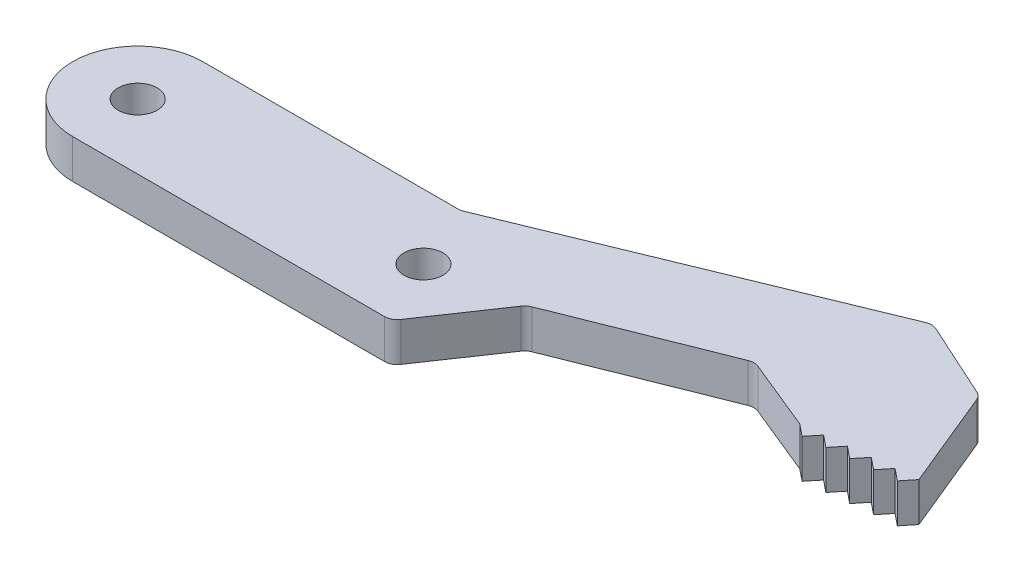
ISO-10303-21;
HEADER;
FILE_DESCRIPTION(('STEP AP214'),'2;1');
FILE_NAME('part.step','',(''),(''),'','','');
FILE_SCHEMA(('AUTOMOTIVE_DESIGN { 1 0 10303 214 1 1 1 1 }'));
ENDSEC;
DATA;
#1=APPLICATION_CONTEXT('core data for automotive mechanical design processes');
#2=APPLICATION_PROTOCOL_DEFINITION('international standard','automotive_design',2000,#1);
#3=PRODUCT_CONTEXT('',#1,'mechanical');
#4=PRODUCT('Part','Part','',(#3));
#5=PRODUCT_RELATED_PRODUCT_CATEGORY('part','',(#4));
#6=PRODUCT_DEFINITION_FORMATION('','',#4);
#7=PRODUCT_DEFINITION_CONTEXT('part definition',#1,'design');
#8=PRODUCT_DEFINITION('design','',#6,#7);
#9=PRODUCT_DEFINITION_SHAPE('','',#8);
#10=(LENGTH_UNIT() NAMED_UNIT(*) SI_UNIT(.MILLI.,.METRE.));
#11=(NAMED_UNIT(*) PLANE_ANGLE_UNIT() SI_UNIT($,.RADIAN.));
#12=(NAMED_UNIT(*) SI_UNIT($,.STERADIAN.) SOLID_ANGLE_UNIT());
#13=UNCERTAINTY_MEASURE_WITH_UNIT(LENGTH_MEASURE(1.E-05),#10,'distance_accuracy_value','');
#14=(GEOMETRIC_REPRESENTATION_CONTEXT(3) GLOBAL_UNCERTAINTY_ASSIGNED_CONTEXT((#13)) GLOBAL_UNIT_ASSIGNED_CONTEXT((#10,
#11,#12)) REPRESENTATION_CONTEXT('',''));
#15=CARTESIAN_POINT('',(0.,0.,0.));
#16=DIRECTION('',(0.,0.,1.));
#17=DIRECTION('',(1.,0.,0.));
#18=AXIS2_PLACEMENT_3D('',#15,#16,#17);
#19=CARTESIAN_POINT('',(29.3927079970185,3.,-0.393076672311641));
#20=DIRECTION('',(0.,-1.,0.));
#21=DIRECTION('',(0.,0.,-1.));
#22=AXIS2_PLACEMENT_3D('',#19,#20,#21);
#23=PLANE('',#22);
#24=CARTESIAN_POINT('',(29.3927079970185,3.,-0.393076672311641));
#25=DIRECTION('',(0.,-1.,0.));
#26=DIRECTION('',(0.,0.,-1.));
#27=AXIS2_PLACEMENT_3D('',#24,#25,#26);
#28=CIRCLE('',#27,1.);
#29=CARTESIAN_POINT('',(28.5649413257824,3.,-0.954149161381216));
#30=VERTEX_POINT('',#29);
#31=CARTESIAN_POINT('',(29.022312673,3.,-1.32195088551018));
#32=VERTEX_POINT('',#31);
#33=EDGE_CURVE('E282',#30,#32,#28,.T.);
#34=ORIENTED_EDGE('',*,*,#33,.T.);
#35=DIRECTION('',(0.92887421319854,0.,-0.370395324018532));
#36=VECTOR('',#35,1.);
#37=CARTESIAN_POINT('',(29.022312673,3.,-1.32195088551018));
#38=LINE('',#37,#36);
#39=CARTESIAN_POINT('',(40.9295532164884,3.,-6.07004934341117));
#40=VERTEX_POINT('',#39);
#41=EDGE_CURVE('E145',#32,#40,#38,.T.);
#42=ORIENTED_EDGE('',*,*,#41,.T.);
#43=CARTESIAN_POINT('',(41.2999485405069,3.,-5.14117513021263));
#44=DIRECTION('',(0.,-1.,0.));
#45=DIRECTION('',(0.,0.,-1.));
#46=AXIS2_PLACEMENT_3D('',#43,#44,#45);
#47=CIRCLE('',#46,1.);
#48=CARTESIAN_POINT('',(41.6787586893829,3.,-6.06664953348294));
#49=VERTEX_POINT('',#48);
#50=EDGE_CURVE('E348',#40,#49,#47,.T.);
#51=ORIENTED_EDGE('',*,*,#50,.T.);
#52=DIRECTION('',(0.925474403270305,0.,0.378810148876022));
#53=VECTOR('',#52,1.);
#54=CARTESIAN_POINT('',(41.6787586893829,3.,-6.06664953348294));
#55=LINE('',#54,#53);
#56=CARTESIAN_POINT('',(47.1445862437582,3.,-3.82940672883367));
#57=VERTEX_POINT('',#56);
#58=EDGE_CURVE('E367',#49,#57,#55,.T.);
#59=ORIENTED_EDGE('',*,*,#58,.T.);
#60=DIRECTION('',(0.777249081254573,0.,0.629193027368329));
#61=VECTOR('',#60,1.);
#62=CARTESIAN_POINT('',(47.1445862437582,3.,-3.82940672883367));
#63=LINE('',#62,#61);
#64=CARTESIAN_POINT('',(48.0617401596386,3.,-3.08695895653906));
#65=VERTEX_POINT('',#64);
#66=EDGE_CURVE('E364',#57,#65,#63,.T.);
#67=ORIENTED_EDGE('',*,*,#66,.T.);
#68=DIRECTION('',(0.629193027368274,0.,-0.777249081254617));
#69=VECTOR('',#68,1.);
#70=CARTESIAN_POINT('',(48.0617401596386,3.,-3.08695895653906));
#71=LINE('',#70,#69);
#72=CARTESIAN_POINT('',(48.8041879319331,3.,-4.0041128724195));
#73=VERTEX_POINT('',#72);
#74=EDGE_CURVE('E366',#65,#73,#71,.T.);
#75=ORIENTED_EDGE('',*,*,#74,.T.);
#76=DIRECTION('',(0.777249081254579,0.,0.62919302736832));
#77=VECTOR('',#76,1.);
#78=CARTESIAN_POINT('',(48.8041879319331,3.,-4.0041128724195));
#79=LINE('',#78,#77);
#80=CARTESIAN_POINT('',(49.7213418478136,3.,-3.26166510012488));
#81=VERTEX_POINT('',#80);
#82=EDGE_CURVE('E369',#73,#81,#79,.T.);
#83=ORIENTED_EDGE('',*,*,#82,.T.);
#84=DIRECTION('',(0.629193027368325,0.,-0.777249081254575));
#85=VECTOR('',#84,1.);
#86=CARTESIAN_POINT('',(49.7213418478136,3.,-3.26166510012488));
#87=LINE('',#86,#85);
#88=CARTESIAN_POINT('',(50.4637896201082,3.,-4.17881901600528));
#89=VERTEX_POINT('',#88);
#90=EDGE_CURVE('E375',#81,#89,#87,.T.);
#91=ORIENTED_EDGE('',*,*,#90,.T.);
#92=DIRECTION('',(0.777249081254577,0.,0.629193027368323));
#93=VECTOR('',#92,1.);
#94=CARTESIAN_POINT('',(50.4637896201082,3.,-4.17881901600528));
#95=LINE('',#94,#93);
#96=CARTESIAN_POINT('',(51.3809435359886,3.,-3.43637124371065));
#97=VERTEX_POINT('',#96);
#98=EDGE_CURVE('E377',#89,#97,#95,.T.);
#99=ORIENTED_EDGE('',*,*,#98,.T.);
#100=DIRECTION('',(0.629193027368326,0.,-0.777249081254575));
#101=VECTOR('',#100,1.);
#102=CARTESIAN_POINT('',(51.3809435359886,3.,-3.43637124371065));
#103=LINE('',#102,#101);
#104=CARTESIAN_POINT('',(52.1233913082832,3.,-4.35352515959105));
#105=VERTEX_POINT('',#104);
#106=EDGE_CURVE('E379',#97,#105,#103,.T.);
#107=ORIENTED_EDGE('',*,*,#106,.T.);
#108=DIRECTION('',(0.777249081254583,0.,0.629193027368317));
#109=VECTOR('',#108,1.);
#110=CARTESIAN_POINT('',(52.1233913082832,3.,-4.35352515959105));
#111=LINE('',#110,#109);
#112=CARTESIAN_POINT('',(53.0405452241636,3.,-3.61107738729644));
#113=VERTEX_POINT('',#112);
#114=EDGE_CURVE('E381',#105,#113,#111,.T.);
#115=ORIENTED_EDGE('',*,*,#114,.T.);
#116=DIRECTION('',(0.629193027368326,0.,-0.777249081254575));
#117=VECTOR('',#116,1.);
#118=CARTESIAN_POINT('',(53.0405452241636,3.,-3.61107738729644));
#119=LINE('',#118,#117);
#120=CARTESIAN_POINT('',(53.7829929964582,3.,-4.52823130317683));
#121=VERTEX_POINT('',#120);
#122=EDGE_CURVE('E383',#113,#121,#119,.T.);
#123=ORIENTED_EDGE('',*,*,#122,.T.);
#124=DIRECTION('',(0.777249081254587,0.,0.629193027368311));
#125=VECTOR('',#124,1.);
#126=CARTESIAN_POINT('',(53.7829929964582,3.,-4.52823130317683));
#127=LINE('',#126,#125);
#128=CARTESIAN_POINT('',(54.7001469123387,3.,-3.78578353088222));
#129=VERTEX_POINT('',#128);
#130=EDGE_CURVE('E385',#121,#129,#127,.T.);
#131=ORIENTED_EDGE('',*,*,#130,.T.);
#132=DIRECTION('',(0.629193027368273,0.,-0.777249081254618));
#133=VECTOR('',#132,1.);
#134=CARTESIAN_POINT('',(54.7001469123387,3.,-3.78578353088222));
#135=LINE('',#134,#133);
#136=CARTESIAN_POINT('',(55.4425946846332,3.,-4.70293744676266));
#137=VERTEX_POINT('',#136);
#138=EDGE_CURVE('E387',#129,#137,#135,.T.);
#139=ORIENTED_EDGE('',*,*,#138,.T.);
#140=DIRECTION('',(-0.380263412733204,0.,-0.92487822816655));
#141=VECTOR('',#140,1.);
#142=CARTESIAN_POINT('',(52.341745918113,3.,-12.2448345027485));
#143=LINE('',#142,#141);
#144=CARTESIAN_POINT('',(52.341745918113,3.,-12.2448345027485));
#145=VERTEX_POINT('',#144);
#146=EDGE_CURVE('E389',#137,#145,#143,.T.);
#147=ORIENTED_EDGE('',*,*,#146,.T.);
#148=CARTESIAN_POINT('',(51.4168676899464,3.,-11.8645710900153));
#149=DIRECTION('',(0.,1.,0.));
#150=DIRECTION('',(0.,0.,-1.));
#151=AXIS2_PLACEMENT_3D('',#148,#149,#150);
#152=CIRCLE('',#151,1.);
#153=CARTESIAN_POINT('',(51.8314021080849,3.,-12.7746047246566));
#154=VERTEX_POINT('',#153);
#155=EDGE_CURVE('E391',#145,#154,#152,.T.);
#156=ORIENTED_EDGE('',*,*,#155,.T.);
#157=DIRECTION('',(-0.910033634641374,0.,-0.414534418138482));
#158=VECTOR('',#157,1.);
#159=CARTESIAN_POINT('',(46.0241839243038,3.,-15.4198825684427));
#160=LINE('',#159,#158);
#161=CARTESIAN_POINT('',(46.0241839243038,3.,-15.4198825684427));
#162=VERTEX_POINT('',#161);
#163=EDGE_CURVE('E393',#154,#162,#160,.T.);
#164=ORIENTED_EDGE('',*,*,#163,.T.);
#165=CARTESIAN_POINT('',(45.6096495061653,3.,-14.5098489338013));
#166=DIRECTION('',(0.,1.,0.));
#167=DIRECTION('',(0.,0.,-1.));
#168=AXIS2_PLACEMENT_3D('',#165,#166,#167);
#169=CIRCLE('',#168,1.);
#170=CARTESIAN_POINT('',(45.2293860934321,3.,-15.4347271619678));
#171=VERTEX_POINT('',#170);
#172=EDGE_CURVE('E395',#162,#171,#169,.T.);
#173=ORIENTED_EDGE('',*,*,#172,.T.);
#174=DIRECTION('',(-0.924878228166549,0.,0.380263412733207));
#175=VECTOR('',#174,1.);
#176=CARTESIAN_POINT('',(20.0327114807882,3.,-5.07512177183345));
#177=LINE('',#176,#175);
#178=CARTESIAN_POINT('',(20.0327114807882,3.,-5.07512177183345));
#179=VERTEX_POINT('',#178);
#180=EDGE_CURVE('E397',#171,#179,#177,.T.);
#181=ORIENTED_EDGE('',*,*,#180,.T.);
#182=CARTESIAN_POINT('',(19.652448068055,3.,-6.));
#183=DIRECTION('',(0.,-1.,0.));
#184=DIRECTION('',(0.,0.,1.));
#185=AXIS2_PLACEMENT_3D('',#182,#183,#184);
#186=CIRCLE('',#185,1.);
#187=CARTESIAN_POINT('',(19.652448068055,3.,-5.));
#188=VERTEX_POINT('',#187);
#189=EDGE_CURVE('E399',#179,#188,#186,.T.);
#190=ORIENTED_EDGE('',*,*,#189,.T.);
#191=DIRECTION('',(-1.,0.,0.));
#192=VECTOR('',#191,1.);
#193=CARTESIAN_POINT('',(0.,3.,-5.));
#194=LINE('',#193,#192);
#195=CARTESIAN_POINT('',(0.,3.,-5.));
#196=VERTEX_POINT('',#195);
#197=EDGE_CURVE('E401',#188,#196,#194,.T.);
#198=ORIENTED_EDGE('',*,*,#197,.T.);
#199=CARTESIAN_POINT('',(0.,3.,0.));
#200=DIRECTION('',(0.,1.,0.));
#201=DIRECTION('',(0.,0.,1.));
#202=AXIS2_PLACEMENT_3D('',#199,#200,#201);
#203=CIRCLE('',#202,5.);
#204=CARTESIAN_POINT('',(0.,3.,5.));
#205=VERTEX_POINT('',#204);
#206=EDGE_CURVE('E215',#196,#205,#203,.T.);
#207=ORIENTED_EDGE('',*,*,#206,.T.);
#208=DIRECTION('',(1.,0.,0.));
#209=VECTOR('',#208,1.);
#210=CARTESIAN_POINT('',(0.,3.,5.));
#211=LINE('',#210,#209);
#212=CARTESIAN_POINT('',(23.9988758721515,3.,5.));
#213=VERTEX_POINT('',#212);
#214=EDGE_CURVE('E209',#205,#213,#211,.T.);
#215=ORIENTED_EDGE('',*,*,#214,.T.);
#216=CARTESIAN_POINT('',(23.9988758721515,3.,4.));
#217=DIRECTION('',(0.,1.,0.));
#218=DIRECTION('',(0.,0.,1.));
#219=AXIS2_PLACEMENT_3D('',#216,#217,#218);
#220=CIRCLE('',#219,1.);
#221=CARTESIAN_POINT('',(24.8266425433876,3.,4.56107248906957));
#222=VERTEX_POINT('',#221);
#223=EDGE_CURVE('E213',#213,#222,#220,.T.);
#224=ORIENTED_EDGE('',*,*,#223,.T.);
#225=DIRECTION('',(0.561072489069578,0.,-0.827766671236085));
#226=VECTOR('',#225,1.);
#227=CARTESIAN_POINT('',(24.8266425433876,3.,4.56107248906957));
#228=LINE('',#227,#226);
#229=EDGE_CURVE('E51',#222,#30,#228,.T.);
#230=ORIENTED_EDGE('',*,*,#229,.T.);
#231=EDGE_LOOP('',(#34,#42,#51,#59,#67,#75,#83,#91,#99,#107,#115,#123,#131,#139,#147,#156,#164,
#173,#181,#190,#198,#207,#215,#224,#230));
#232=FACE_BOUND('',#231,.T.);
#233=CARTESIAN_POINT('',(0.,3.,0.));
#234=DIRECTION('',(0.,1.,0.));
#235=DIRECTION('',(0.,0.,1.));
#236=AXIS2_PLACEMENT_3D('',#233,#234,#235);
#237=CIRCLE('',#236,1.5);
#238=CARTESIAN_POINT('',(0.,3.,1.5));
#239=VERTEX_POINT('',#238);
#240=EDGE_CURVE('E237',#239,#239,#237,.T.);
#241=ORIENTED_EDGE('',*,*,#240,.F.);
#242=EDGE_LOOP('',(#241));
#243=FACE_BOUND('',#242,.T.);
#244=CARTESIAN_POINT('',(22.,3.,0.));
#245=DIRECTION('',(0.,1.,0.));
#246=DIRECTION('',(0.,0.,1.));
#247=AXIS2_PLACEMENT_3D('',#244,#245,#246);
#248=CIRCLE('',#247,1.5);
#249=CARTESIAN_POINT('',(22.,3.,1.5));
#250=VERTEX_POINT('',#249);
#251=EDGE_CURVE('E442',#250,#250,#248,.T.);
#252=ORIENTED_EDGE('',*,*,#251,.F.);
#253=EDGE_LOOP('',(#252));
#254=FACE_BOUND('',#253,.T.);
#255=ADVANCED_FACE('F34',(#232,#243,#254),#23,.F.);
#256=CARTESIAN_POINT('',(29.3927079970185,0.,-0.393076672311641));
#257=DIRECTION('',(0.,-1.,0.));
#258=DIRECTION('',(0.,0.,-1.));
#259=AXIS2_PLACEMENT_3D('',#256,#257,#258);
#260=PLANE('',#259);
#261=CARTESIAN_POINT('',(0.,0.,0.));
#262=DIRECTION('',(0.,1.,0.));
#263=DIRECTION('',(0.,0.,1.));
#264=AXIS2_PLACEMENT_3D('',#261,#262,#263);
#265=CIRCLE('',#264,1.5);
#266=CARTESIAN_POINT('',(0.,0.,1.5));
#267=VERTEX_POINT('',#266);
#268=EDGE_CURVE('E447',#267,#267,#265,.T.);
#269=ORIENTED_EDGE('',*,*,#268,.T.);
#270=EDGE_LOOP('',(#269));
#271=FACE_BOUND('',#270,.T.);
#272=CARTESIAN_POINT('',(29.3927079970185,0.,-0.393076672311641));
#273=DIRECTION('',(0.,-1.,0.));
#274=DIRECTION('',(0.,0.,-1.));
#275=AXIS2_PLACEMENT_3D('',#272,#273,#274);
#276=CIRCLE('',#275,1.);
#277=CARTESIAN_POINT('',(28.5649413257824,0.,-0.954149161381216));
#278=VERTEX_POINT('',#277);
#279=CARTESIAN_POINT('',(29.022312673,0.,-1.32195088551018));
#280=VERTEX_POINT('',#279);
#281=EDGE_CURVE('E233',#278,#280,#276,.T.);
#282=ORIENTED_EDGE('',*,*,#281,.F.);
#283=DIRECTION('',(0.561072489069578,0.,-0.827766671236085));
#284=VECTOR('',#283,1.);
#285=CARTESIAN_POINT('',(24.8266425433876,0.,4.56107248906957));
#286=LINE('',#285,#284);
#287=CARTESIAN_POINT('',(24.8266425433876,0.,4.56107248906957));
#288=VERTEX_POINT('',#287);
#289=EDGE_CURVE('E137',#288,#278,#286,.T.);
#290=ORIENTED_EDGE('',*,*,#289,.F.);
#291=CARTESIAN_POINT('',(23.9988758721515,0.,4.));
#292=DIRECTION('',(0.,1.,0.));
#293=DIRECTION('',(0.,0.,1.));
#294=AXIS2_PLACEMENT_3D('',#291,#292,#293);
#295=CIRCLE('',#294,1.);
#296=CARTESIAN_POINT('',(23.9988758721515,0.,5.));
#297=VERTEX_POINT('',#296);
#298=EDGE_CURVE('E131',#297,#288,#295,.T.);
#299=ORIENTED_EDGE('',*,*,#298,.F.);
#300=DIRECTION('',(1.,0.,0.));
#301=VECTOR('',#300,1.);
#302=CARTESIAN_POINT('',(0.,0.,5.));
#303=LINE('',#302,#301);
#304=CARTESIAN_POINT('',(0.,0.,5.));
#305=VERTEX_POINT('',#304);
#306=EDGE_CURVE('E223',#305,#297,#303,.T.);
#307=ORIENTED_EDGE('',*,*,#306,.F.);
#308=CARTESIAN_POINT('',(0.,0.,0.));
#309=DIRECTION('',(0.,1.,0.));
#310=DIRECTION('',(0.,0.,1.));
#311=AXIS2_PLACEMENT_3D('',#308,#309,#310);
#312=CIRCLE('',#311,5.);
#313=CARTESIAN_POINT('',(0.,0.,-5.));
#314=VERTEX_POINT('',#313);
#315=EDGE_CURVE('E277',#314,#305,#312,.T.);
#316=ORIENTED_EDGE('',*,*,#315,.F.);
#317=DIRECTION('',(-1.,0.,0.));
#318=VECTOR('',#317,1.);
#319=CARTESIAN_POINT('',(0.,0.,-5.));
#320=LINE('',#319,#318);
#321=CARTESIAN_POINT('',(19.652448068055,0.,-5.));
#322=VERTEX_POINT('',#321);
#323=EDGE_CURVE('E275',#322,#314,#320,.T.);
#324=ORIENTED_EDGE('',*,*,#323,.F.);
#325=CARTESIAN_POINT('',(19.652448068055,0.,-6.));
#326=DIRECTION('',(0.,-1.,0.));
#327=DIRECTION('',(0.,0.,1.));
#328=AXIS2_PLACEMENT_3D('',#325,#326,#327);
#329=CIRCLE('',#328,1.);
#330=CARTESIAN_POINT('',(20.0327114807882,0.,-5.07512177183345));
#331=VERTEX_POINT('',#330);
#332=EDGE_CURVE('E273',#331,#322,#329,.T.);
#333=ORIENTED_EDGE('',*,*,#332,.F.);
#334=DIRECTION('',(-0.924878228166549,0.,0.380263412733207));
#335=VECTOR('',#334,1.);
#336=CARTESIAN_POINT('',(20.0327114807882,0.,-5.07512177183345));
#337=LINE('',#336,#335);
#338=CARTESIAN_POINT('',(45.2293860934321,0.,-15.4347271619678));
#339=VERTEX_POINT('',#338);
#340=EDGE_CURVE('E271',#339,#331,#337,.T.);
#341=ORIENTED_EDGE('',*,*,#340,.F.);
#342=CARTESIAN_POINT('',(45.6096495061653,0.,-14.5098489338013));
#343=DIRECTION('',(0.,1.,0.));
#344=DIRECTION('',(0.,0.,-1.));
#345=AXIS2_PLACEMENT_3D('',#342,#343,#344);
#346=CIRCLE('',#345,1.);
#347=CARTESIAN_POINT('',(46.0241839243038,0.,-15.4198825684427));
#348=VERTEX_POINT('',#347);
#349=EDGE_CURVE('E269',#348,#339,#346,.T.);
#350=ORIENTED_EDGE('',*,*,#349,.F.);
#351=DIRECTION('',(-0.910033634641374,0.,-0.414534418138482));
#352=VECTOR('',#351,1.);
#353=CARTESIAN_POINT('',(46.0241839243038,0.,-15.4198825684427));
#354=LINE('',#353,#352);
#355=CARTESIAN_POINT('',(51.8314021080849,0.,-12.7746047246566));
#356=VERTEX_POINT('',#355);
#357=EDGE_CURVE('E267',#356,#348,#354,.T.);
#358=ORIENTED_EDGE('',*,*,#357,.F.);
#359=CARTESIAN_POINT('',(51.4168676899464,0.,-11.8645710900153));
#360=DIRECTION('',(0.,1.,0.));
#361=DIRECTION('',(0.,0.,-1.));
#362=AXIS2_PLACEMENT_3D('',#359,#360,#361);
#363=CIRCLE('',#362,1.);
#364=CARTESIAN_POINT('',(52.341745918113,0.,-12.2448345027485));
#365=VERTEX_POINT('',#364);
#366=EDGE_CURVE('E265',#365,#356,#363,.T.);
#367=ORIENTED_EDGE('',*,*,#366,.F.);
#368=DIRECTION('',(-0.380263412733204,0.,-0.92487822816655));
#369=VECTOR('',#368,1.);
#370=CARTESIAN_POINT('',(52.341745918113,0.,-12.2448345027485));
#371=LINE('',#370,#369);
#372=CARTESIAN_POINT('',(55.4425946846332,0.,-4.70293744676266));
#373=VERTEX_POINT('',#372);
#374=EDGE_CURVE('E263',#373,#365,#371,.T.);
#375=ORIENTED_EDGE('',*,*,#374,.F.);
#376=DIRECTION('',(0.629193027368273,0.,-0.777249081254618));
#377=VECTOR('',#376,1.);
#378=CARTESIAN_POINT('',(54.7001469123387,0.,-3.78578353088222));
#379=LINE('',#378,#377);
#380=CARTESIAN_POINT('',(54.7001469123387,0.,-3.78578353088222));
#381=VERTEX_POINT('',#380);
#382=EDGE_CURVE('E261',#381,#373,#379,.T.);
#383=ORIENTED_EDGE('',*,*,#382,.F.);
#384=DIRECTION('',(0.777249081254587,0.,0.629193027368311));
#385=VECTOR('',#384,1.);
#386=CARTESIAN_POINT('',(53.7829929964582,0.,-4.52823130317683));
#387=LINE('',#386,#385);
#388=CARTESIAN_POINT('',(53.7829929964582,0.,-4.52823130317683));
#389=VERTEX_POINT('',#388);
#390=EDGE_CURVE('E259',#389,#381,#387,.T.);
#391=ORIENTED_EDGE('',*,*,#390,.F.);
#392=DIRECTION('',(0.629193027368326,0.,-0.777249081254575));
#393=VECTOR('',#392,1.);
#394=CARTESIAN_POINT('',(53.0405452241636,0.,-3.61107738729644));
#395=LINE('',#394,#393);
#396=CARTESIAN_POINT('',(53.0405452241636,0.,-3.61107738729644));
#397=VERTEX_POINT('',#396);
#398=EDGE_CURVE('E257',#397,#389,#395,.T.);
#399=ORIENTED_EDGE('',*,*,#398,.F.);
#400=DIRECTION('',(0.777249081254583,0.,0.629193027368317));
#401=VECTOR('',#400,1.);
#402=CARTESIAN_POINT('',(52.1233913082832,0.,-4.35352515959105));
#403=LINE('',#402,#401);
#404=CARTESIAN_POINT('',(52.1233913082832,0.,-4.35352515959105));
#405=VERTEX_POINT('',#404);
#406=EDGE_CURVE('E255',#405,#397,#403,.T.);
#407=ORIENTED_EDGE('',*,*,#406,.F.);
#408=DIRECTION('',(0.629193027368326,0.,-0.777249081254575));
#409=VECTOR('',#408,1.);
#410=CARTESIAN_POINT('',(51.3809435359886,0.,-3.43637124371065));
#411=LINE('',#410,#409);
#412=CARTESIAN_POINT('',(51.3809435359886,0.,-3.43637124371065));
#413=VERTEX_POINT('',#412);
#414=EDGE_CURVE('E253',#413,#405,#411,.T.);
#415=ORIENTED_EDGE('',*,*,#414,.F.);
#416=DIRECTION('',(0.777249081254577,0.,0.629193027368323));
#417=VECTOR('',#416,1.);
#418=CARTESIAN_POINT('',(50.4637896201082,0.,-4.17881901600528));
#419=LINE('',#418,#417);
#420=CARTESIAN_POINT('',(50.4637896201082,0.,-4.17881901600528));
#421=VERTEX_POINT('',#420);
#422=EDGE_CURVE('E251',#421,#413,#419,.T.);
#423=ORIENTED_EDGE('',*,*,#422,.F.);
#424=DIRECTION('',(0.629193027368325,0.,-0.777249081254575));
#425=VECTOR('',#424,1.);
#426=CARTESIAN_POINT('',(49.7213418478136,0.,-3.26166510012488));
#427=LINE('',#426,#425);
#428=CARTESIAN_POINT('',(49.7213418478136,0.,-3.26166510012488));
#429=VERTEX_POINT('',#428);
#430=EDGE_CURVE('E249',#429,#421,#427,.T.);
#431=ORIENTED_EDGE('',*,*,#430,.F.);
#432=DIRECTION('',(0.777249081254579,0.,0.62919302736832));
#433=VECTOR('',#432,1.);
#434=CARTESIAN_POINT('',(48.8041879319331,0.,-4.0041128724195));
#435=LINE('',#434,#433);
#436=CARTESIAN_POINT('',(48.8041879319331,0.,-4.0041128724195));
#437=VERTEX_POINT('',#436);
#438=EDGE_CURVE('E247',#437,#429,#435,.T.);
#439=ORIENTED_EDGE('',*,*,#438,.F.);
#440=DIRECTION('',(0.629193027368274,0.,-0.777249081254617));
#441=VECTOR('',#440,1.);
#442=CARTESIAN_POINT('',(48.0617401596386,0.,-3.08695895653906));
#443=LINE('',#442,#441);
#444=CARTESIAN_POINT('',(48.0617401596386,0.,-3.08695895653906));
#445=VERTEX_POINT('',#444);
#446=EDGE_CURVE('E245',#445,#437,#443,.T.);
#447=ORIENTED_EDGE('',*,*,#446,.F.);
#448=DIRECTION('',(0.777249081254573,0.,0.629193027368329));
#449=VECTOR('',#448,1.);
#450=CARTESIAN_POINT('',(47.1445862437582,0.,-3.82940672883367));
#451=LINE('',#450,#449);
#452=CARTESIAN_POINT('',(47.1445862437582,0.,-3.82940672883367));
#453=VERTEX_POINT('',#452);
#454=EDGE_CURVE('E243',#453,#445,#451,.T.);
#455=ORIENTED_EDGE('',*,*,#454,.F.);
#456=DIRECTION('',(0.925474403270305,0.,0.378810148876022));
#457=VECTOR('',#456,1.);
#458=CARTESIAN_POINT('',(41.6787586893829,0.,-6.06664953348294));
#459=LINE('',#458,#457);
#460=CARTESIAN_POINT('',(41.6787586893829,0.,-6.06664953348294));
#461=VERTEX_POINT('',#460);
#462=EDGE_CURVE('E241',#461,#453,#459,.T.);
#463=ORIENTED_EDGE('',*,*,#462,.F.);
#464=CARTESIAN_POINT('',(41.2999485405069,0.,-5.14117513021263));
#465=DIRECTION('',(0.,-1.,0.));
#466=DIRECTION('',(0.,0.,-1.));
#467=AXIS2_PLACEMENT_3D('',#464,#465,#466);
#468=CIRCLE('',#467,1.);
#469=CARTESIAN_POINT('',(40.9295532164884,0.,-6.07004934341117));
#470=VERTEX_POINT('',#469);
#471=EDGE_CURVE('E239',#470,#461,#468,.T.);
#472=ORIENTED_EDGE('',*,*,#471,.F.);
#473=DIRECTION('',(0.92887421319854,0.,-0.370395324018532));
#474=VECTOR('',#473,1.);
#475=CARTESIAN_POINT('',(29.022312673,0.,-1.32195088551018));
#476=LINE('',#475,#474);
#477=EDGE_CURVE('E236',#280,#470,#476,.T.);
#478=ORIENTED_EDGE('',*,*,#477,.F.);
#479=EDGE_LOOP('',(#282,#290,#299,#307,#316,#324,#333,#341,#350,#358,#367,#375,#383,#391,#399,
#407,#415,#423,#431,#439,#447,#455,#463,#472,#478));
#480=FACE_BOUND('',#479,.T.);
#481=CARTESIAN_POINT('',(22.,0.,0.));
#482=DIRECTION('',(0.,1.,0.));
#483=DIRECTION('',(0.,0.,1.));
#484=AXIS2_PLACEMENT_3D('',#481,#482,#483);
#485=CIRCLE('',#484,1.5);
#486=CARTESIAN_POINT('',(22.,0.,1.5));
#487=VERTEX_POINT('',#486);
#488=EDGE_CURVE('E445',#487,#487,#485,.T.);
#489=ORIENTED_EDGE('',*,*,#488,.T.);
#490=EDGE_LOOP('',(#489));
#491=FACE_BOUND('',#490,.T.);
#492=ADVANCED_FACE('F352',(#271,#480,#491),#260,.T.);
#493=CARTESIAN_POINT('',(29.3927079970185,3.,-0.393076672311641));
#494=DIRECTION('',(0.,-1.,0.));
#495=DIRECTION('',(0.,0.,-1.));
#496=AXIS2_PLACEMENT_3D('',#493,#494,#495);
#497=CYLINDRICAL_SURFACE('',#496,1.);
#498=ORIENTED_EDGE('',*,*,#281,.T.);
#499=DIRECTION('',(0.,-1.,0.));
#500=VECTOR('',#499,1.);
#501=CARTESIAN_POINT('',(29.022312673,3.,-1.32195088551018));
#502=LINE('',#501,#500);
#503=EDGE_CURVE('E11',#32,#280,#502,.T.);
#504=ORIENTED_EDGE('',*,*,#503,.F.);
#505=ORIENTED_EDGE('',*,*,#33,.F.);
#506=DIRECTION('',(0.,-1.,0.));
#507=VECTOR('',#506,1.);
#508=CARTESIAN_POINT('',(28.5649413257824,3.,-0.954149161381216));
#509=LINE('',#508,#507);
#510=EDGE_CURVE('E229',#30,#278,#509,.T.);
#511=ORIENTED_EDGE('',*,*,#510,.T.);
#512=EDGE_LOOP('',(#498,#504,#505,#511));
#513=FACE_BOUND('',#512,.T.);
#514=ADVANCED_FACE('F36',(#513),#497,.F.);
#515=CARTESIAN_POINT('',(29.022312673,3.,-1.32195088551018));
#516=DIRECTION('',(-0.370395324018532,0.,-0.92887421319854));
#517=DIRECTION('',(-0.92887421319854,0.,0.370395324018532));
#518=AXIS2_PLACEMENT_3D('',#515,#516,#517);
#519=PLANE('',#518);
#520=ORIENTED_EDGE('',*,*,#477,.T.);
#521=DIRECTION('',(0.,-1.,0.));
#522=VECTOR('',#521,1.);
#523=CARTESIAN_POINT('',(40.9295532164884,3.,-6.07004934341117));
#524=LINE('',#523,#522);
#525=EDGE_CURVE('E43',#40,#470,#524,.T.);
#526=ORIENTED_EDGE('',*,*,#525,.F.);
#527=ORIENTED_EDGE('',*,*,#41,.F.);
#528=ORIENTED_EDGE('',*,*,#503,.T.);
#529=EDGE_LOOP('',(#520,#526,#527,#528));
#530=FACE_BOUND('',#529,.T.);
#531=ADVANCED_FACE('F672',(#530),#519,.F.);
#532=CARTESIAN_POINT('',(41.2999485405069,3.,-5.14117513021263));
#533=DIRECTION('',(0.,-1.,0.));
#534=DIRECTION('',(0.,0.,-1.));
#535=AXIS2_PLACEMENT_3D('',#532,#533,#534);
#536=CYLINDRICAL_SURFACE('',#535,1.);
#537=ORIENTED_EDGE('',*,*,#471,.T.);
#538=DIRECTION('',(0.,-1.,0.));
#539=VECTOR('',#538,1.);
#540=CARTESIAN_POINT('',(41.6787586893829,3.,-6.06664953348294));
#541=LINE('',#540,#539);
#542=EDGE_CURVE('E340',#49,#461,#541,.T.);
#543=ORIENTED_EDGE('',*,*,#542,.F.);
#544=ORIENTED_EDGE('',*,*,#50,.F.);
#545=ORIENTED_EDGE('',*,*,#525,.T.);
#546=EDGE_LOOP('',(#537,#543,#544,#545));
#547=FACE_BOUND('',#546,.T.);
#548=ADVANCED_FACE('F346',(#547),#536,.F.);
#549=CARTESIAN_POINT('',(41.6787586893829,3.,-6.06664953348294));
#550=DIRECTION('',(0.378810148876022,0.,-0.925474403270305));
#551=DIRECTION('',(-0.925474403270305,0.,-0.378810148876022));
#552=AXIS2_PLACEMENT_3D('',#549,#550,#551);
#553=PLANE('',#552);
#554=ORIENTED_EDGE('',*,*,#462,.T.);
#555=DIRECTION('',(0.,-1.,0.));
#556=VECTOR('',#555,1.);
#557=CARTESIAN_POINT('',(47.1445862437582,3.,-3.82940672883367));
#558=LINE('',#557,#556);
#559=EDGE_CURVE('E337',#57,#453,#558,.T.);
#560=ORIENTED_EDGE('',*,*,#559,.F.);
#561=ORIENTED_EDGE('',*,*,#58,.F.);
#562=ORIENTED_EDGE('',*,*,#542,.T.);
#563=EDGE_LOOP('',(#554,#560,#561,#562));
#564=FACE_BOUND('',#563,.T.);
#565=ADVANCED_FACE('F358',(#564),#553,.F.);
#566=CARTESIAN_POINT('',(47.1445862437582,3.,-3.82940672883367));
#567=DIRECTION('',(0.629193027368329,0.,-0.777249081254573));
#568=DIRECTION('',(-0.777249081254573,0.,-0.629193027368329));
#569=AXIS2_PLACEMENT_3D('',#566,#567,#568);
#570=PLANE('',#569);
#571=ORIENTED_EDGE('',*,*,#454,.T.);
#572=DIRECTION('',(0.,-1.,0.));
#573=VECTOR('',#572,1.);
#574=CARTESIAN_POINT('',(48.0617401596386,3.,-3.08695895653906));
#575=LINE('',#574,#573);
#576=EDGE_CURVE('E334',#65,#445,#575,.T.);
#577=ORIENTED_EDGE('',*,*,#576,.F.);
#578=ORIENTED_EDGE('',*,*,#66,.F.);
#579=ORIENTED_EDGE('',*,*,#559,.T.);
#580=EDGE_LOOP('',(#571,#577,#578,#579));
#581=FACE_BOUND('',#580,.T.);
#582=ADVANCED_FACE('F362',(#581),#570,.F.);
#583=CARTESIAN_POINT('',(48.0617401596386,3.,-3.08695895653906));
#584=DIRECTION('',(-0.777249081254617,0.,-0.629193027368274));
#585=DIRECTION('',(-0.629193027368274,0.,0.777249081254617));
#586=AXIS2_PLACEMENT_3D('',#583,#584,#585);
#587=PLANE('',#586);
#588=ORIENTED_EDGE('',*,*,#446,.T.);
#589=DIRECTION('',(0.,-1.,0.));
#590=VECTOR('',#589,1.);
#591=CARTESIAN_POINT('',(48.8041879319331,3.,-4.0041128724195));
#592=LINE('',#591,#590);
#593=EDGE_CURVE('E331',#73,#437,#592,.T.);
#594=ORIENTED_EDGE('',*,*,#593,.F.);
#595=ORIENTED_EDGE('',*,*,#74,.F.);
#596=ORIENTED_EDGE('',*,*,#576,.T.);
#597=EDGE_LOOP('',(#588,#594,#595,#596));
#598=FACE_BOUND('',#597,.T.);
#599=ADVANCED_FACE('F637',(#598),#587,.F.);
#600=CARTESIAN_POINT('',(48.8041879319331,3.,-4.0041128724195));
#601=DIRECTION('',(0.62919302736832,0.,-0.77724908125458));
#602=DIRECTION('',(-0.77724908125458,0.,-0.62919302736832));
#603=AXIS2_PLACEMENT_3D('',#600,#601,#602);
#604=PLANE('',#603);
#605=ORIENTED_EDGE('',*,*,#438,.T.);
#606=DIRECTION('',(0.,-1.,0.));
#607=VECTOR('',#606,1.);
#608=CARTESIAN_POINT('',(49.7213418478136,3.,-3.26166510012488));
#609=LINE('',#608,#607);
#610=EDGE_CURVE('E328',#81,#429,#609,.T.);
#611=ORIENTED_EDGE('',*,*,#610,.F.);
#612=ORIENTED_EDGE('',*,*,#82,.F.);
#613=ORIENTED_EDGE('',*,*,#593,.T.);
#614=EDGE_LOOP('',(#605,#611,#612,#613));
#615=FACE_BOUND('',#614,.T.);
#616=ADVANCED_FACE('F627',(#615),#604,.F.);
#617=CARTESIAN_POINT('',(49.7213418478136,3.,-3.26166510012488));
#618=DIRECTION('',(-0.777249081254575,0.,-0.629193027368325));
#619=DIRECTION('',(-0.629193027368325,0.,0.777249081254576));
#620=AXIS2_PLACEMENT_3D('',#617,#618,#619);
#621=PLANE('',#620);
#622=ORIENTED_EDGE('',*,*,#430,.T.);
#623=DIRECTION('',(0.,-1.,0.));
#624=VECTOR('',#623,1.);
#625=CARTESIAN_POINT('',(50.4637896201082,3.,-4.17881901600528));
#626=LINE('',#625,#624);
#627=EDGE_CURVE('E325',#89,#421,#626,.T.);
#628=ORIENTED_EDGE('',*,*,#627,.F.);
#629=ORIENTED_EDGE('',*,*,#90,.F.);
#630=ORIENTED_EDGE('',*,*,#610,.T.);
#631=EDGE_LOOP('',(#622,#628,#629,#630));
#632=FACE_BOUND('',#631,.T.);
#633=ADVANCED_FACE('F617',(#632),#621,.F.);
#634=CARTESIAN_POINT('',(50.4637896201082,3.,-4.17881901600528));
#635=DIRECTION('',(0.629193027368323,0.,-0.777249081254577));
#636=DIRECTION('',(-0.777249081254577,0.,-0.629193027368323));
#637=AXIS2_PLACEMENT_3D('',#634,#635,#636);
#638=PLANE('',#637);
#639=ORIENTED_EDGE('',*,*,#422,.T.);
#640=DIRECTION('',(0.,-1.,0.));
#641=VECTOR('',#640,1.);
#642=CARTESIAN_POINT('',(51.3809435359886,3.,-3.43637124371065));
#643=LINE('',#642,#641);
#644=EDGE_CURVE('E322',#97,#413,#643,.T.);
#645=ORIENTED_EDGE('',*,*,#644,.F.);
#646=ORIENTED_EDGE('',*,*,#98,.F.);
#647=ORIENTED_EDGE('',*,*,#627,.T.);
#648=EDGE_LOOP('',(#639,#645,#646,#647));
#649=FACE_BOUND('',#648,.T.);
#650=ADVANCED_FACE('F607',(#649),#638,.F.);
#651=CARTESIAN_POINT('',(51.3809435359886,3.,-3.43637124371065));
#652=DIRECTION('',(-0.777249081254575,0.,-0.629193027368326));
#653=DIRECTION('',(-0.629193027368326,0.,0.777249081254575));
#654=AXIS2_PLACEMENT_3D('',#651,#652,#653);
#655=PLANE('',#654);
#656=ORIENTED_EDGE('',*,*,#414,.T.);
#657=DIRECTION('',(0.,-1.,0.));
#658=VECTOR('',#657,1.);
#659=CARTESIAN_POINT('',(52.1233913082832,3.,-4.35352515959105));
#660=LINE('',#659,#658);
#661=EDGE_CURVE('E319',#105,#405,#660,.T.);
#662=ORIENTED_EDGE('',*,*,#661,.F.);
#663=ORIENTED_EDGE('',*,*,#106,.F.);
#664=ORIENTED_EDGE('',*,*,#644,.T.);
#665=EDGE_LOOP('',(#656,#662,#663,#664));
#666=FACE_BOUND('',#665,.T.);
#667=ADVANCED_FACE('F597',(#666),#655,.F.);
#668=CARTESIAN_POINT('',(52.1233913082832,3.,-4.35352515959105));
#669=DIRECTION('',(0.629193027368317,0.,-0.777249081254583));
#670=DIRECTION('',(-0.777249081254583,0.,-0.629193027368317));
#671=AXIS2_PLACEMENT_3D('',#668,#669,#670);
#672=PLANE('',#671);
#673=ORIENTED_EDGE('',*,*,#406,.T.);
#674=DIRECTION('',(0.,-1.,0.));
#675=VECTOR('',#674,1.);
#676=CARTESIAN_POINT('',(53.0405452241636,3.,-3.61107738729644));
#677=LINE('',#676,#675);
#678=EDGE_CURVE('E316',#113,#397,#677,.T.);
#679=ORIENTED_EDGE('',*,*,#678,.F.);
#680=ORIENTED_EDGE('',*,*,#114,.F.);
#681=ORIENTED_EDGE('',*,*,#661,.T.);
#682=EDGE_LOOP('',(#673,#679,#680,#681));
#683=FACE_BOUND('',#682,.T.);
#684=ADVANCED_FACE('F587',(#683),#672,.F.);
#685=CARTESIAN_POINT('',(53.0405452241636,3.,-3.61107738729644));
#686=DIRECTION('',(-0.777249081254575,0.,-0.629193027368326));
#687=DIRECTION('',(-0.629193027368326,0.,0.777249081254575));
#688=AXIS2_PLACEMENT_3D('',#685,#686,#687);
#689=PLANE('',#688);
#690=ORIENTED_EDGE('',*,*,#398,.T.);
#691=DIRECTION('',(0.,-1.,0.));
#692=VECTOR('',#691,1.);
#693=CARTESIAN_POINT('',(53.7829929964582,3.,-4.52823130317683));
#694=LINE('',#693,#692);
#695=EDGE_CURVE('E313',#121,#389,#694,.T.);
#696=ORIENTED_EDGE('',*,*,#695,.F.);
#697=ORIENTED_EDGE('',*,*,#122,.F.);
#698=ORIENTED_EDGE('',*,*,#678,.T.);
#699=EDGE_LOOP('',(#690,#696,#697,#698));
#700=FACE_BOUND('',#699,.T.);
#701=ADVANCED_FACE('F577',(#700),#689,.F.);
#702=CARTESIAN_POINT('',(53.7829929964582,3.,-4.52823130317683));
#703=DIRECTION('',(0.629193027368311,0.,-0.777249081254587));
#704=DIRECTION('',(-0.777249081254587,0.,-0.629193027368311));
#705=AXIS2_PLACEMENT_3D('',#702,#703,#704);
#706=PLANE('',#705);
#707=ORIENTED_EDGE('',*,*,#390,.T.);
#708=DIRECTION('',(0.,-1.,0.));
#709=VECTOR('',#708,1.);
#710=CARTESIAN_POINT('',(54.7001469123387,3.,-3.78578353088222));
#711=LINE('',#710,#709);
#712=EDGE_CURVE('E310',#129,#381,#711,.T.);
#713=ORIENTED_EDGE('',*,*,#712,.F.);
#714=ORIENTED_EDGE('',*,*,#130,.F.);
#715=ORIENTED_EDGE('',*,*,#695,.T.);
#716=EDGE_LOOP('',(#707,#713,#714,#715));
#717=FACE_BOUND('',#716,.T.);
#718=ADVANCED_FACE('F567',(#717),#706,.F.);
#719=CARTESIAN_POINT('',(54.7001469123387,3.,-3.78578353088222));
#720=DIRECTION('',(-0.777249081254618,0.,-0.629193027368273));
#721=DIRECTION('',(-0.629193027368273,0.,0.777249081254618));
#722=AXIS2_PLACEMENT_3D('',#719,#720,#721);
#723=PLANE('',#722);
#724=ORIENTED_EDGE('',*,*,#382,.T.);
#725=DIRECTION('',(0.,-1.,0.));
#726=VECTOR('',#725,1.);
#727=CARTESIAN_POINT('',(55.4425946846332,3.,-4.70293744676266));
#728=LINE('',#727,#726);
#729=EDGE_CURVE('E307',#137,#373,#728,.T.);
#730=ORIENTED_EDGE('',*,*,#729,.F.);
#731=ORIENTED_EDGE('',*,*,#138,.F.);
#732=ORIENTED_EDGE('',*,*,#712,.T.);
#733=EDGE_LOOP('',(#724,#730,#731,#732));
#734=FACE_BOUND('',#733,.T.);
#735=ADVANCED_FACE('F557',(#734),#723,.F.);
#736=CARTESIAN_POINT('',(52.341745918113,3.,-12.2448345027485));
#737=DIRECTION('',(-0.92487822816655,0.,0.380263412733204));
#738=DIRECTION('',(0.380263412733204,0.,0.92487822816655));
#739=AXIS2_PLACEMENT_3D('',#736,#737,#738);
#740=PLANE('',#739);
#741=ORIENTED_EDGE('',*,*,#374,.T.);
#742=DIRECTION('',(0.,-1.,0.));
#743=VECTOR('',#742,1.);
#744=CARTESIAN_POINT('',(52.341745918113,3.,-12.2448345027485));
#745=LINE('',#744,#743);
#746=EDGE_CURVE('E304',#145,#365,#745,.T.);
#747=ORIENTED_EDGE('',*,*,#746,.F.);
#748=ORIENTED_EDGE('',*,*,#146,.F.);
#749=ORIENTED_EDGE('',*,*,#729,.T.);
#750=EDGE_LOOP('',(#741,#747,#748,#749));
#751=FACE_BOUND('',#750,.T.);
#752=ADVANCED_FACE('F547',(#751),#740,.F.);
#753=CARTESIAN_POINT('',(51.4168676899464,3.,-11.8645710900153));
#754=DIRECTION('',(0.,-1.,0.));
#755=DIRECTION('',(0.,0.,-1.));
#756=AXIS2_PLACEMENT_3D('',#753,#754,#755);
#757=CYLINDRICAL_SURFACE('',#756,1.);
#758=ORIENTED_EDGE('',*,*,#366,.T.);
#759=DIRECTION('',(0.,-1.,0.));
#760=VECTOR('',#759,1.);
#761=CARTESIAN_POINT('',(51.8314021080849,3.,-12.7746047246566));
#762=LINE('',#761,#760);
#763=EDGE_CURVE('E301',#154,#356,#762,.T.);
#764=ORIENTED_EDGE('',*,*,#763,.F.);
#765=ORIENTED_EDGE('',*,*,#155,.F.);
#766=ORIENTED_EDGE('',*,*,#746,.T.);
#767=EDGE_LOOP('',(#758,#764,#765,#766));
#768=FACE_BOUND('',#767,.T.);
#769=ADVANCED_FACE('F537',(#768),#757,.T.);
#770=CARTESIAN_POINT('',(46.0241839243038,3.,-15.4198825684427));
#771=DIRECTION('',(-0.414534418138482,0.,0.910033634641374));
#772=DIRECTION('',(0.910033634641374,0.,0.414534418138482));
#773=AXIS2_PLACEMENT_3D('',#770,#771,#772);
#774=PLANE('',#773);
#775=ORIENTED_EDGE('',*,*,#357,.T.);
#776=DIRECTION('',(0.,-1.,0.));
#777=VECTOR('',#776,1.);
#778=CARTESIAN_POINT('',(46.0241839243038,3.,-15.4198825684427));
#779=LINE('',#778,#777);
#780=EDGE_CURVE('E298',#162,#348,#779,.T.);
#781=ORIENTED_EDGE('',*,*,#780,.F.);
#782=ORIENTED_EDGE('',*,*,#163,.F.);
#783=ORIENTED_EDGE('',*,*,#763,.T.);
#784=EDGE_LOOP('',(#775,#781,#782,#783));
#785=FACE_BOUND('',#784,.T.);
#786=ADVANCED_FACE('F527',(#785),#774,.F.);
#787=CARTESIAN_POINT('',(45.6096495061653,3.,-14.5098489338013));
#788=DIRECTION('',(0.,-1.,0.));
#789=DIRECTION('',(0.,0.,-1.));
#790=AXIS2_PLACEMENT_3D('',#787,#788,#789);
#791=CYLINDRICAL_SURFACE('',#790,1.);
#792=ORIENTED_EDGE('',*,*,#349,.T.);
#793=DIRECTION('',(0.,-1.,0.));
#794=VECTOR('',#793,1.);
#795=CARTESIAN_POINT('',(45.2293860934321,3.,-15.4347271619678));
#796=LINE('',#795,#794);
#797=EDGE_CURVE('E295',#171,#339,#796,.T.);
#798=ORIENTED_EDGE('',*,*,#797,.F.);
#799=ORIENTED_EDGE('',*,*,#172,.F.);
#800=ORIENTED_EDGE('',*,*,#780,.T.);
#801=EDGE_LOOP('',(#792,#798,#799,#800));
#802=FACE_BOUND('',#801,.T.);
#803=ADVANCED_FACE('F517',(#802),#791,.T.);
#804=CARTESIAN_POINT('',(20.0327114807882,3.,-5.07512177183345));
#805=DIRECTION('',(0.380263412733207,0.,0.924878228166549));
#806=DIRECTION('',(0.924878228166549,0.,-0.380263412733207));
#807=AXIS2_PLACEMENT_3D('',#804,#805,#806);
#808=PLANE('',#807);
#809=ORIENTED_EDGE('',*,*,#340,.T.);
#810=DIRECTION('',(0.,-1.,0.));
#811=VECTOR('',#810,1.);
#812=CARTESIAN_POINT('',(20.0327114807882,3.,-5.07512177183345));
#813=LINE('',#812,#811);
#814=EDGE_CURVE('E292',#179,#331,#813,.T.);
#815=ORIENTED_EDGE('',*,*,#814,.F.);
#816=ORIENTED_EDGE('',*,*,#180,.F.);
#817=ORIENTED_EDGE('',*,*,#797,.T.);
#818=EDGE_LOOP('',(#809,#815,#816,#817));
#819=FACE_BOUND('',#818,.T.);
#820=ADVANCED_FACE('F507',(#819),#808,.F.);
#821=CARTESIAN_POINT('',(19.652448068055,3.,-6.));
#822=DIRECTION('',(0.,-1.,0.));
#823=DIRECTION('',(0.,0.,-1.));
#824=AXIS2_PLACEMENT_3D('',#821,#822,#823);
#825=CYLINDRICAL_SURFACE('',#824,1.);
#826=ORIENTED_EDGE('',*,*,#332,.T.);
#827=DIRECTION('',(0.,-1.,0.));
#828=VECTOR('',#827,1.);
#829=CARTESIAN_POINT('',(19.652448068055,3.,-5.));
#830=LINE('',#829,#828);
#831=EDGE_CURVE('E289',#188,#322,#830,.T.);
#832=ORIENTED_EDGE('',*,*,#831,.F.);
#833=ORIENTED_EDGE('',*,*,#189,.F.);
#834=ORIENTED_EDGE('',*,*,#814,.T.);
#835=EDGE_LOOP('',(#826,#832,#833,#834));
#836=FACE_BOUND('',#835,.T.);
#837=ADVANCED_FACE('F498',(#836),#825,.F.);
#838=CARTESIAN_POINT('',(0.,3.,-5.));
#839=DIRECTION('',(0.,0.,1.));
#840=DIRECTION('',(1.,0.,0.));
#841=AXIS2_PLACEMENT_3D('',#838,#839,#840);
#842=PLANE('',#841);
#843=ORIENTED_EDGE('',*,*,#323,.T.);
#844=DIRECTION('',(0.,-1.,0.));
#845=VECTOR('',#844,1.);
#846=CARTESIAN_POINT('',(0.,3.,-5.));
#847=LINE('',#846,#845);
#848=EDGE_CURVE('E286',#196,#314,#847,.T.);
#849=ORIENTED_EDGE('',*,*,#848,.F.);
#850=ORIENTED_EDGE('',*,*,#197,.F.);
#851=ORIENTED_EDGE('',*,*,#831,.T.);
#852=EDGE_LOOP('',(#843,#849,#850,#851));
#853=FACE_BOUND('',#852,.T.);
#854=ADVANCED_FACE('F407',(#853),#842,.F.);
#855=CARTESIAN_POINT('',(0.,3.,0.));
#856=DIRECTION('',(0.,-1.,0.));
#857=DIRECTION('',(0.,0.,-1.));
#858=AXIS2_PLACEMENT_3D('',#855,#856,#857);
#859=CYLINDRICAL_SURFACE('',#858,5.);
#860=ORIENTED_EDGE('',*,*,#315,.T.);
#861=DIRECTION('',(0.,-1.,0.));
#862=VECTOR('',#861,1.);
#863=CARTESIAN_POINT('',(0.,3.,5.));
#864=LINE('',#863,#862);
#865=EDGE_CURVE('E224',#205,#305,#864,.T.);
#866=ORIENTED_EDGE('',*,*,#865,.F.);
#867=ORIENTED_EDGE('',*,*,#206,.F.);
#868=ORIENTED_EDGE('',*,*,#848,.T.);
#869=EDGE_LOOP('',(#860,#866,#867,#868));
#870=FACE_BOUND('',#869,.T.);
#871=ADVANCED_FACE('F411',(#870),#859,.T.);
#872=CARTESIAN_POINT('',(0.,3.,5.));
#873=DIRECTION('',(0.,0.,-1.));
#874=DIRECTION('',(-1.,0.,0.));
#875=AXIS2_PLACEMENT_3D('',#872,#873,#874);
#876=PLANE('',#875);
#877=ORIENTED_EDGE('',*,*,#306,.T.);
#878=DIRECTION('',(0.,-1.,0.));
#879=VECTOR('',#878,1.);
#880=CARTESIAN_POINT('',(23.9988758721515,3.,5.));
#881=LINE('',#880,#879);
#882=EDGE_CURVE('E220',#213,#297,#881,.T.);
#883=ORIENTED_EDGE('',*,*,#882,.F.);
#884=ORIENTED_EDGE('',*,*,#214,.F.);
#885=ORIENTED_EDGE('',*,*,#865,.T.);
#886=EDGE_LOOP('',(#877,#883,#884,#885));
#887=FACE_BOUND('',#886,.T.);
#888=ADVANCED_FACE('F221',(#887),#876,.F.);
#889=CARTESIAN_POINT('',(23.9988758721515,3.,4.));
#890=DIRECTION('',(0.,-1.,0.));
#891=DIRECTION('',(0.,0.,-1.));
#892=AXIS2_PLACEMENT_3D('',#889,#890,#891);
#893=CYLINDRICAL_SURFACE('',#892,1.);
#894=ORIENTED_EDGE('',*,*,#298,.T.);
#895=DIRECTION('',(0.,-1.,0.));
#896=VECTOR('',#895,1.);
#897=CARTESIAN_POINT('',(24.8266425433876,3.,4.56107248906957));
#898=LINE('',#897,#896);
#899=EDGE_CURVE('E225',#222,#288,#898,.T.);
#900=ORIENTED_EDGE('',*,*,#899,.F.);
#901=ORIENTED_EDGE('',*,*,#223,.F.);
#902=ORIENTED_EDGE('',*,*,#882,.T.);
#903=EDGE_LOOP('',(#894,#900,#901,#902));
#904=FACE_BOUND('',#903,.T.);
#905=ADVANCED_FACE('F227',(#904),#893,.T.);
#906=CARTESIAN_POINT('',(24.8266425433876,3.,4.56107248906957));
#907=DIRECTION('',(-0.827766671236085,0.,-0.561072489069578));
#908=DIRECTION('',(-0.561072489069578,0.,0.827766671236085));
#909=AXIS2_PLACEMENT_3D('',#906,#907,#908);
#910=PLANE('',#909);
#911=ORIENTED_EDGE('',*,*,#289,.T.);
#912=ORIENTED_EDGE('',*,*,#510,.F.);
#913=ORIENTED_EDGE('',*,*,#229,.F.);
#914=ORIENTED_EDGE('',*,*,#899,.T.);
#915=EDGE_LOOP('',(#911,#912,#913,#914));
#916=FACE_BOUND('',#915,.T.);
#917=ADVANCED_FACE('F415',(#916),#910,.F.);
#918=CARTESIAN_POINT('',(0.,3.,0.));
#919=DIRECTION('',(0.,-1.,0.));
#920=DIRECTION('',(0.,0.,-1.));
#921=AXIS2_PLACEMENT_3D('',#918,#919,#920);
#922=CYLINDRICAL_SURFACE('',#921,1.5);
#923=ORIENTED_EDGE('',*,*,#240,.T.);
#924=EDGE_LOOP('',(#923));
#925=FACE_BOUND('',#924,.T.);
#926=ORIENTED_EDGE('',*,*,#268,.F.);
#927=EDGE_LOOP('',(#926));
#928=FACE_BOUND('',#927,.T.);
#929=ADVANCED_FACE('F417',(#925,#928),#922,.F.);
#930=CARTESIAN_POINT('',(22.,3.,0.));
#931=DIRECTION('',(0.,-1.,0.));
#932=DIRECTION('',(0.,0.,-1.));
#933=AXIS2_PLACEMENT_3D('',#930,#931,#932);
#934=CYLINDRICAL_SURFACE('',#933,1.5);
#935=ORIENTED_EDGE('',*,*,#251,.T.);
#936=EDGE_LOOP('',(#935));
#937=FACE_BOUND('',#936,.T.);
#938=ORIENTED_EDGE('',*,*,#488,.F.);
#939=EDGE_LOOP('',(#938));
#940=FACE_BOUND('',#939,.T.);
#941=ADVANCED_FACE('F423',(#937,#940),#934,.F.);
#942=CLOSED_SHELL('',(#255,#492,#514,#531,#548,#565,#582,#599,#616,#633,#650,#667,#684,#701,
#718,#735,#752,#769,#786,#803,#820,#837,#854,#871,#888,#905,#917,#929,#941));
#943=MANIFOLD_SOLID_BREP('B2',#942);
#944=ADVANCED_BREP_SHAPE_REPRESENTATION('',(#18,#943),#14);
#945=SHAPE_DEFINITION_REPRESENTATION(#9,#944);
ENDSEC;
END-ISO-10303-21;
